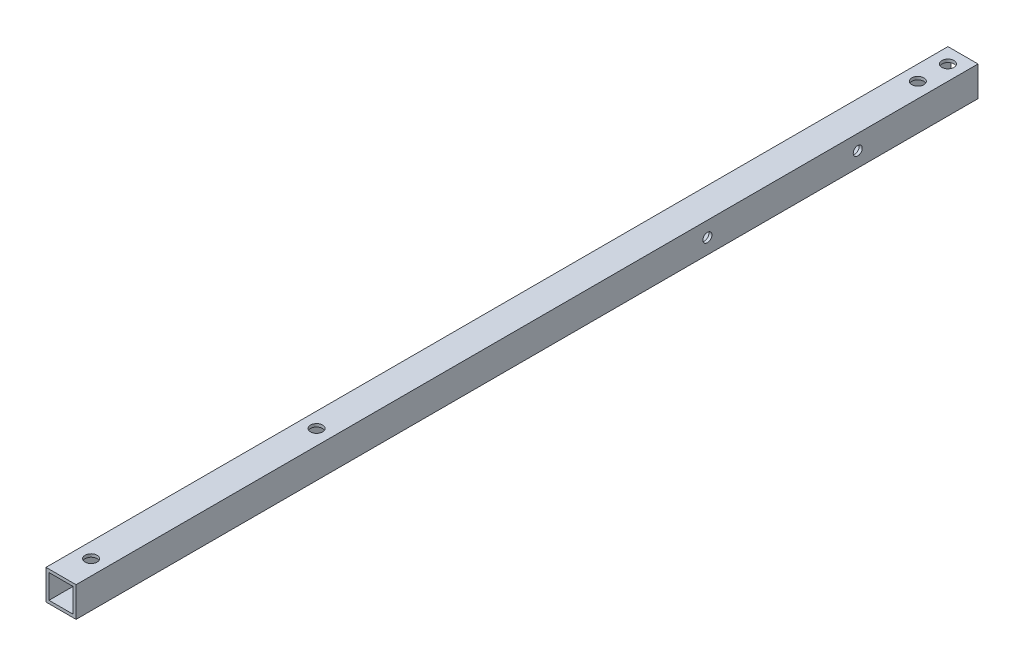
ISO-10303-21;
HEADER;
FILE_DESCRIPTION(('STEP AP214'),'2;1');
FILE_NAME('part.step','',(''),(''),'','','');
FILE_SCHEMA(('AUTOMOTIVE_DESIGN { 1 0 10303 214 1 1 1 1 }'));
ENDSEC;
DATA;
#1=APPLICATION_CONTEXT('core data for automotive mechanical design processes');
#2=APPLICATION_PROTOCOL_DEFINITION('international standard','automotive_design',2000,#1);
#3=PRODUCT_CONTEXT('',#1,'mechanical');
#4=PRODUCT('Part','Part','',(#3));
#5=PRODUCT_RELATED_PRODUCT_CATEGORY('part','',(#4));
#6=PRODUCT_DEFINITION_FORMATION('','',#4);
#7=PRODUCT_DEFINITION_CONTEXT('part definition',#1,'design');
#8=PRODUCT_DEFINITION('design','',#6,#7);
#9=PRODUCT_DEFINITION_SHAPE('','',#8);
#10=(LENGTH_UNIT() NAMED_UNIT(*) SI_UNIT(.MILLI.,.METRE.));
#11=(NAMED_UNIT(*) PLANE_ANGLE_UNIT() SI_UNIT($,.RADIAN.));
#12=(NAMED_UNIT(*) SI_UNIT($,.STERADIAN.) SOLID_ANGLE_UNIT());
#13=UNCERTAINTY_MEASURE_WITH_UNIT(LENGTH_MEASURE(1.E-05),#10,'distance_accuracy_value','');
#14=(GEOMETRIC_REPRESENTATION_CONTEXT(3) GLOBAL_UNCERTAINTY_ASSIGNED_CONTEXT((#13)) GLOBAL_UNIT_ASSIGNED_CONTEXT((#10,
#11,#12)) REPRESENTATION_CONTEXT('',''));
#15=CARTESIAN_POINT('',(0.,0.,0.));
#16=DIRECTION('',(0.,0.,1.));
#17=DIRECTION('',(1.,0.,0.));
#18=AXIS2_PLACEMENT_3D('',#15,#16,#17);
#19=CARTESIAN_POINT('',(0.,0.,300.));
#20=DIRECTION('',(0.,0.,1.));
#21=DIRECTION('',(1.,0.,0.));
#22=AXIS2_PLACEMENT_3D('',#19,#20,#21);
#23=PLANE('',#22);
#24=DIRECTION('',(0.,-1.,0.));
#25=VECTOR('',#24,1.);
#26=CARTESIAN_POINT('',(0.,0.,300.));
#27=LINE('',#26,#25);
#28=CARTESIAN_POINT('',(0.,0.,300.));
#29=VERTEX_POINT('',#28);
#30=CARTESIAN_POINT('',(0.,-10.,300.));
#31=VERTEX_POINT('',#30);
#32=EDGE_CURVE('E143',#29,#31,#27,.T.);
#33=ORIENTED_EDGE('',*,*,#32,.T.);
#34=DIRECTION('',(1.,0.,0.));
#35=VECTOR('',#34,1.);
#36=CARTESIAN_POINT('',(0.,-10.,300.));
#37=LINE('',#36,#35);
#38=CARTESIAN_POINT('',(10.,-10.,300.));
#39=VERTEX_POINT('',#38);
#40=EDGE_CURVE('E146',#31,#39,#37,.T.);
#41=ORIENTED_EDGE('',*,*,#40,.T.);
#42=DIRECTION('',(0.,1.,0.));
#43=VECTOR('',#42,1.);
#44=CARTESIAN_POINT('',(10.,0.,300.));
#45=LINE('',#44,#43);
#46=CARTESIAN_POINT('',(10.,0.,300.));
#47=VERTEX_POINT('',#46);
#48=EDGE_CURVE('E149',#39,#47,#45,.T.);
#49=ORIENTED_EDGE('',*,*,#48,.T.);
#50=DIRECTION('',(-1.,0.,0.));
#51=VECTOR('',#50,1.);
#52=CARTESIAN_POINT('',(0.,0.,300.));
#53=LINE('',#52,#51);
#54=EDGE_CURVE('E151',#47,#29,#53,.T.);
#55=ORIENTED_EDGE('',*,*,#54,.T.);
#56=EDGE_LOOP('',(#33,#41,#49,#55));
#57=FACE_BOUND('',#56,.T.);
#58=DIRECTION('',(1.,0.,0.));
#59=VECTOR('',#58,1.);
#60=CARTESIAN_POINT('',(1.,-9.,300.));
#61=LINE('',#60,#59);
#62=CARTESIAN_POINT('',(1.,-9.,300.));
#63=VERTEX_POINT('',#62);
#64=CARTESIAN_POINT('',(9.00000000000001,-9.,300.));
#65=VERTEX_POINT('',#64);
#66=EDGE_CURVE('E113',#63,#65,#61,.T.);
#67=ORIENTED_EDGE('',*,*,#66,.F.);
#68=DIRECTION('',(0.,-1.,0.));
#69=VECTOR('',#68,1.);
#70=CARTESIAN_POINT('',(1.,-1.,300.));
#71=LINE('',#70,#69);
#72=CARTESIAN_POINT('',(1.,-1.,300.));
#73=VERTEX_POINT('',#72);
#74=EDGE_CURVE('E105',#73,#63,#71,.T.);
#75=ORIENTED_EDGE('',*,*,#74,.F.);
#76=DIRECTION('',(-1.,0.,0.));
#77=VECTOR('',#76,1.);
#78=CARTESIAN_POINT('',(1.,-1.,300.));
#79=LINE('',#78,#77);
#80=CARTESIAN_POINT('',(9.,-1.,300.));
#81=VERTEX_POINT('',#80);
#82=EDGE_CURVE('E127',#81,#73,#79,.T.);
#83=ORIENTED_EDGE('',*,*,#82,.F.);
#84=DIRECTION('',(0.,1.,0.));
#85=VECTOR('',#84,1.);
#86=CARTESIAN_POINT('',(9.,-1.,300.));
#87=LINE('',#86,#85);
#88=EDGE_CURVE('E125',#65,#81,#87,.T.);
#89=ORIENTED_EDGE('',*,*,#88,.F.);
#90=EDGE_LOOP('',(#67,#75,#83,#89));
#91=FACE_BOUND('',#90,.T.);
#92=ADVANCED_FACE('F38',(#57,#91),#23,.T.);
#93=CARTESIAN_POINT('',(0.,0.,0.));
#94=DIRECTION('',(0.,0.,1.));
#95=DIRECTION('',(1.,0.,0.));
#96=AXIS2_PLACEMENT_3D('',#93,#94,#95);
#97=PLANE('',#96);
#98=DIRECTION('',(0.,-1.,0.));
#99=VECTOR('',#98,1.);
#100=CARTESIAN_POINT('',(0.,0.,0.));
#101=LINE('',#100,#99);
#102=CARTESIAN_POINT('',(0.,0.,0.));
#103=VERTEX_POINT('',#102);
#104=CARTESIAN_POINT('',(0.,-10.,0.));
#105=VERTEX_POINT('',#104);
#106=EDGE_CURVE('E121',#103,#105,#101,.T.);
#107=ORIENTED_EDGE('',*,*,#106,.F.);
#108=DIRECTION('',(-1.,0.,0.));
#109=VECTOR('',#108,1.);
#110=CARTESIAN_POINT('',(0.,0.,0.));
#111=LINE('',#110,#109);
#112=CARTESIAN_POINT('',(10.,0.,0.));
#113=VERTEX_POINT('',#112);
#114=EDGE_CURVE('E147',#113,#103,#111,.T.);
#115=ORIENTED_EDGE('',*,*,#114,.F.);
#116=DIRECTION('',(0.,1.,0.));
#117=VECTOR('',#116,1.);
#118=CARTESIAN_POINT('',(10.,0.,0.));
#119=LINE('',#118,#117);
#120=CARTESIAN_POINT('',(10.,-10.,0.));
#121=VERTEX_POINT('',#120);
#122=EDGE_CURVE('E158',#121,#113,#119,.T.);
#123=ORIENTED_EDGE('',*,*,#122,.F.);
#124=DIRECTION('',(1.,0.,0.));
#125=VECTOR('',#124,1.);
#126=CARTESIAN_POINT('',(0.,-10.,0.));
#127=LINE('',#126,#125);
#128=EDGE_CURVE('E156',#105,#121,#127,.T.);
#129=ORIENTED_EDGE('',*,*,#128,.F.);
#130=EDGE_LOOP('',(#107,#115,#123,#129));
#131=FACE_BOUND('',#130,.T.);
#132=DIRECTION('',(0.,-1.,0.));
#133=VECTOR('',#132,1.);
#134=CARTESIAN_POINT('',(1.,-1.,0.));
#135=LINE('',#134,#133);
#136=CARTESIAN_POINT('',(1.,-1.,0.));
#137=VERTEX_POINT('',#136);
#138=CARTESIAN_POINT('',(1.,-9.,0.));
#139=VERTEX_POINT('',#138);
#140=EDGE_CURVE('E63',#137,#139,#135,.T.);
#141=ORIENTED_EDGE('',*,*,#140,.T.);
#142=DIRECTION('',(1.,0.,0.));
#143=VECTOR('',#142,1.);
#144=CARTESIAN_POINT('',(1.,-9.,0.));
#145=LINE('',#144,#143);
#146=CARTESIAN_POINT('',(9.00000000000001,-9.,0.));
#147=VERTEX_POINT('',#146);
#148=EDGE_CURVE('E120',#139,#147,#145,.T.);
#149=ORIENTED_EDGE('',*,*,#148,.T.);
#150=DIRECTION('',(0.,1.,0.));
#151=VECTOR('',#150,1.);
#152=CARTESIAN_POINT('',(9.,-1.,0.));
#153=LINE('',#152,#151);
#154=CARTESIAN_POINT('',(9.,-1.,0.));
#155=VERTEX_POINT('',#154);
#156=EDGE_CURVE('E135',#147,#155,#153,.T.);
#157=ORIENTED_EDGE('',*,*,#156,.T.);
#158=DIRECTION('',(-1.,0.,0.));
#159=VECTOR('',#158,1.);
#160=CARTESIAN_POINT('',(1.,-1.,0.));
#161=LINE('',#160,#159);
#162=EDGE_CURVE('E114',#155,#137,#161,.T.);
#163=ORIENTED_EDGE('',*,*,#162,.T.);
#164=EDGE_LOOP('',(#141,#149,#157,#163));
#165=FACE_BOUND('',#164,.T.);
#166=ADVANCED_FACE('F255',(#131,#165),#97,.F.);
#167=CARTESIAN_POINT('',(0.,0.,300.));
#168=DIRECTION('',(1.,0.,0.));
#169=DIRECTION('',(0.,1.,0.));
#170=AXIS2_PLACEMENT_3D('',#167,#168,#169);
#171=PLANE('',#170);
#172=CARTESIAN_POINT('',(0.,-5.00000000000001,90.));
#173=DIRECTION('',(1.,0.,0.));
#174=DIRECTION('',(0.,1.,0.));
#175=AXIS2_PLACEMENT_3D('',#172,#173,#174);
#176=CIRCLE('',#175,1.5);
#177=CARTESIAN_POINT('',(0.,-3.50000000000002,90.));
#178=VERTEX_POINT('',#177);
#179=EDGE_CURVE('E347',#178,#178,#176,.T.);
#180=ORIENTED_EDGE('',*,*,#179,.T.);
#181=EDGE_LOOP('',(#180));
#182=FACE_BOUND('',#181,.T.);
#183=CARTESIAN_POINT('',(0.,-5.00000000000001,40.));
#184=DIRECTION('',(1.,0.,0.));
#185=DIRECTION('',(0.,1.,0.));
#186=AXIS2_PLACEMENT_3D('',#183,#184,#185);
#187=CIRCLE('',#186,1.5);
#188=CARTESIAN_POINT('',(0.,-3.5,40.));
#189=VERTEX_POINT('',#188);
#190=EDGE_CURVE('E189',#189,#189,#187,.T.);
#191=ORIENTED_EDGE('',*,*,#190,.T.);
#192=EDGE_LOOP('',(#191));
#193=FACE_BOUND('',#192,.T.);
#194=ORIENTED_EDGE('',*,*,#106,.T.);
#195=DIRECTION('',(0.,0.,-1.));
#196=VECTOR('',#195,1.);
#197=CARTESIAN_POINT('',(0.,-10.,300.));
#198=LINE('',#197,#196);
#199=EDGE_CURVE('E11',#31,#105,#198,.T.);
#200=ORIENTED_EDGE('',*,*,#199,.F.);
#201=ORIENTED_EDGE('',*,*,#32,.F.);
#202=DIRECTION('',(0.,0.,-1.));
#203=VECTOR('',#202,1.);
#204=CARTESIAN_POINT('',(0.,0.,300.));
#205=LINE('',#204,#203);
#206=EDGE_CURVE('E153',#29,#103,#205,.T.);
#207=ORIENTED_EDGE('',*,*,#206,.T.);
#208=EDGE_LOOP('',(#194,#200,#201,#207));
#209=FACE_BOUND('',#208,.T.);
#210=ADVANCED_FACE('F40',(#182,#193,#209),#171,.F.);
#211=CARTESIAN_POINT('',(0.,-10.,300.));
#212=DIRECTION('',(0.,1.,0.));
#213=DIRECTION('',(0.,0.,1.));
#214=AXIS2_PLACEMENT_3D('',#211,#212,#213);
#215=PLANE('',#214);
#216=CARTESIAN_POINT('',(5.00000000000003,-10.,215.));
#217=DIRECTION('',(0.,1.,0.));
#218=DIRECTION('',(0.,0.,1.));
#219=AXIS2_PLACEMENT_3D('',#216,#217,#218);
#220=CIRCLE('',#219,2.);
#221=CARTESIAN_POINT('',(5.00000000000003,-10.,217.));
#222=VERTEX_POINT('',#221);
#223=EDGE_CURVE('E185',#222,#222,#220,.T.);
#224=ORIENTED_EDGE('',*,*,#223,.T.);
#225=EDGE_LOOP('',(#224));
#226=FACE_BOUND('',#225,.T.);
#227=CARTESIAN_POINT('',(5.00000000000004,-10.,290.));
#228=DIRECTION('',(0.,1.,0.));
#229=DIRECTION('',(0.,0.,1.));
#230=AXIS2_PLACEMENT_3D('',#227,#228,#229);
#231=CIRCLE('',#230,2.);
#232=CARTESIAN_POINT('',(5.00000000000004,-10.,292.));
#233=VERTEX_POINT('',#232);
#234=EDGE_CURVE('E181',#233,#233,#231,.T.);
#235=ORIENTED_EDGE('',*,*,#234,.T.);
#236=EDGE_LOOP('',(#235));
#237=FACE_BOUND('',#236,.T.);
#238=CARTESIAN_POINT('',(5.,-10.,15.));
#239=DIRECTION('',(0.,1.,0.));
#240=DIRECTION('',(0.,0.,1.));
#241=AXIS2_PLACEMENT_3D('',#238,#239,#240);
#242=CIRCLE('',#241,2.);
#243=CARTESIAN_POINT('',(5.,-10.,17.));
#244=VERTEX_POINT('',#243);
#245=EDGE_CURVE('E176',#244,#244,#242,.T.);
#246=ORIENTED_EDGE('',*,*,#245,.T.);
#247=EDGE_LOOP('',(#246));
#248=FACE_BOUND('',#247,.T.);
#249=CARTESIAN_POINT('',(5.,-10.,5.));
#250=DIRECTION('',(0.,1.,0.));
#251=DIRECTION('',(0.,0.,1.));
#252=AXIS2_PLACEMENT_3D('',#249,#250,#251);
#253=CIRCLE('',#252,2.);
#254=CARTESIAN_POINT('',(5.,-10.,7.));
#255=VERTEX_POINT('',#254);
#256=EDGE_CURVE('E171',#255,#255,#253,.T.);
#257=ORIENTED_EDGE('',*,*,#256,.T.);
#258=EDGE_LOOP('',(#257));
#259=FACE_BOUND('',#258,.T.);
#260=ORIENTED_EDGE('',*,*,#128,.T.);
#261=DIRECTION('',(0.,0.,-1.));
#262=VECTOR('',#261,1.);
#263=CARTESIAN_POINT('',(10.,-10.,300.));
#264=LINE('',#263,#262);
#265=EDGE_CURVE('E47',#39,#121,#264,.T.);
#266=ORIENTED_EDGE('',*,*,#265,.F.);
#267=ORIENTED_EDGE('',*,*,#40,.F.);
#268=ORIENTED_EDGE('',*,*,#199,.T.);
#269=EDGE_LOOP('',(#260,#266,#267,#268));
#270=FACE_BOUND('',#269,.T.);
#271=ADVANCED_FACE('F268',(#226,#237,#248,#259,#270),#215,.F.);
#272=CARTESIAN_POINT('',(10.,0.,300.));
#273=DIRECTION('',(-1.,0.,0.));
#274=DIRECTION('',(0.,-1.,0.));
#275=AXIS2_PLACEMENT_3D('',#272,#273,#274);
#276=PLANE('',#275);
#277=CARTESIAN_POINT('',(10.,-5.00000000000001,90.));
#278=DIRECTION('',(1.,0.,0.));
#279=DIRECTION('',(0.,1.,0.));
#280=AXIS2_PLACEMENT_3D('',#277,#278,#279);
#281=CIRCLE('',#280,1.5);
#282=CARTESIAN_POINT('',(10.,-3.50000000000001,90.));
#283=VERTEX_POINT('',#282);
#284=EDGE_CURVE('E346',#283,#283,#281,.T.);
#285=ORIENTED_EDGE('',*,*,#284,.F.);
#286=EDGE_LOOP('',(#285));
#287=FACE_BOUND('',#286,.T.);
#288=CARTESIAN_POINT('',(10.,-5.00000000000001,40.));
#289=DIRECTION('',(1.,0.,0.));
#290=DIRECTION('',(0.,1.,0.));
#291=AXIS2_PLACEMENT_3D('',#288,#289,#290);
#292=CIRCLE('',#291,1.5);
#293=CARTESIAN_POINT('',(10.,-3.5,40.));
#294=VERTEX_POINT('',#293);
#295=EDGE_CURVE('E196',#294,#294,#292,.T.);
#296=ORIENTED_EDGE('',*,*,#295,.F.);
#297=EDGE_LOOP('',(#296));
#298=FACE_BOUND('',#297,.T.);
#299=ORIENTED_EDGE('',*,*,#122,.T.);
#300=DIRECTION('',(0.,0.,-1.));
#301=VECTOR('',#300,1.);
#302=CARTESIAN_POINT('',(10.,0.,300.));
#303=LINE('',#302,#301);
#304=EDGE_CURVE('E163',#47,#113,#303,.T.);
#305=ORIENTED_EDGE('',*,*,#304,.F.);
#306=ORIENTED_EDGE('',*,*,#48,.F.);
#307=ORIENTED_EDGE('',*,*,#265,.T.);
#308=EDGE_LOOP('',(#299,#305,#306,#307));
#309=FACE_BOUND('',#308,.T.);
#310=ADVANCED_FACE('F265',(#287,#298,#309),#276,.F.);
#311=CARTESIAN_POINT('',(0.,0.,300.));
#312=DIRECTION('',(0.,-1.,0.));
#313=DIRECTION('',(0.,0.,-1.));
#314=AXIS2_PLACEMENT_3D('',#311,#312,#313);
#315=PLANE('',#314);
#316=CARTESIAN_POINT('',(5.00000000000003,0.,215.));
#317=DIRECTION('',(0.,1.,0.));
#318=DIRECTION('',(0.,0.,1.));
#319=AXIS2_PLACEMENT_3D('',#316,#317,#318);
#320=CIRCLE('',#319,2.);
#321=CARTESIAN_POINT('',(5.00000000000003,0.,217.));
#322=VERTEX_POINT('',#321);
#323=EDGE_CURVE('E193',#322,#322,#320,.T.);
#324=ORIENTED_EDGE('',*,*,#323,.F.);
#325=EDGE_LOOP('',(#324));
#326=FACE_BOUND('',#325,.T.);
#327=CARTESIAN_POINT('',(5.00000000000004,0.,290.));
#328=DIRECTION('',(0.,1.,0.));
#329=DIRECTION('',(0.,0.,1.));
#330=AXIS2_PLACEMENT_3D('',#327,#328,#329);
#331=CIRCLE('',#330,2.);
#332=CARTESIAN_POINT('',(5.00000000000004,0.,292.));
#333=VERTEX_POINT('',#332);
#334=EDGE_CURVE('E212',#333,#333,#331,.T.);
#335=ORIENTED_EDGE('',*,*,#334,.F.);
#336=EDGE_LOOP('',(#335));
#337=FACE_BOUND('',#336,.T.);
#338=CARTESIAN_POINT('',(5.,0.,15.));
#339=DIRECTION('',(0.,1.,0.));
#340=DIRECTION('',(0.,0.,1.));
#341=AXIS2_PLACEMENT_3D('',#338,#339,#340);
#342=CIRCLE('',#341,2.);
#343=CARTESIAN_POINT('',(5.,0.,17.));
#344=VERTEX_POINT('',#343);
#345=EDGE_CURVE('E219',#344,#344,#342,.T.);
#346=ORIENTED_EDGE('',*,*,#345,.F.);
#347=EDGE_LOOP('',(#346));
#348=FACE_BOUND('',#347,.T.);
#349=CARTESIAN_POINT('',(5.,0.,5.));
#350=DIRECTION('',(0.,1.,0.));
#351=DIRECTION('',(0.,0.,1.));
#352=AXIS2_PLACEMENT_3D('',#349,#350,#351);
#353=CIRCLE('',#352,2.);
#354=CARTESIAN_POINT('',(5.,0.,7.));
#355=VERTEX_POINT('',#354);
#356=EDGE_CURVE('E226',#355,#355,#353,.T.);
#357=ORIENTED_EDGE('',*,*,#356,.F.);
#358=EDGE_LOOP('',(#357));
#359=FACE_BOUND('',#358,.T.);
#360=ORIENTED_EDGE('',*,*,#114,.T.);
#361=ORIENTED_EDGE('',*,*,#206,.F.);
#362=ORIENTED_EDGE('',*,*,#54,.F.);
#363=ORIENTED_EDGE('',*,*,#304,.T.);
#364=EDGE_LOOP('',(#360,#361,#362,#363));
#365=FACE_BOUND('',#364,.T.);
#366=ADVANCED_FACE('F249',(#326,#337,#348,#359,#365),#315,.F.);
#367=CARTESIAN_POINT('',(1.,-1.,300.));
#368=DIRECTION('',(1.,0.,0.));
#369=DIRECTION('',(0.,0.,-1.));
#370=AXIS2_PLACEMENT_3D('',#367,#368,#369);
#371=PLANE('',#370);
#372=CARTESIAN_POINT('',(1.,-5.00000000000001,90.));
#373=DIRECTION('',(1.,0.,0.));
#374=DIRECTION('',(0.,0.,-1.));
#375=AXIS2_PLACEMENT_3D('',#372,#373,#374);
#376=CIRCLE('',#375,1.5);
#377=CARTESIAN_POINT('',(1.,-5.00000000000001,88.5));
#378=VERTEX_POINT('',#377);
#379=EDGE_CURVE('E201',#378,#378,#376,.T.);
#380=ORIENTED_EDGE('',*,*,#379,.F.);
#381=EDGE_LOOP('',(#380));
#382=FACE_BOUND('',#381,.T.);
#383=CARTESIAN_POINT('',(1.,-5.00000000000001,40.));
#384=DIRECTION('',(1.,0.,0.));
#385=DIRECTION('',(0.,0.,-1.));
#386=AXIS2_PLACEMENT_3D('',#383,#384,#385);
#387=CIRCLE('',#386,1.5);
#388=CARTESIAN_POINT('',(1.,-5.00000000000001,38.5));
#389=VERTEX_POINT('',#388);
#390=EDGE_CURVE('E188',#389,#389,#387,.T.);
#391=ORIENTED_EDGE('',*,*,#390,.F.);
#392=EDGE_LOOP('',(#391));
#393=FACE_BOUND('',#392,.T.);
#394=ORIENTED_EDGE('',*,*,#140,.F.);
#395=DIRECTION('',(0.,0.,-1.));
#396=VECTOR('',#395,1.);
#397=CARTESIAN_POINT('',(1.,-1.,300.));
#398=LINE('',#397,#396);
#399=EDGE_CURVE('E109',#73,#137,#398,.T.);
#400=ORIENTED_EDGE('',*,*,#399,.F.);
#401=ORIENTED_EDGE('',*,*,#74,.T.);
#402=DIRECTION('',(0.,0.,-1.));
#403=VECTOR('',#402,1.);
#404=CARTESIAN_POINT('',(1.,-9.,300.));
#405=LINE('',#404,#403);
#406=EDGE_CURVE('E108',#63,#139,#405,.T.);
#407=ORIENTED_EDGE('',*,*,#406,.T.);
#408=EDGE_LOOP('',(#394,#400,#401,#407));
#409=FACE_BOUND('',#408,.T.);
#410=ADVANCED_FACE('F107',(#382,#393,#409),#371,.T.);
#411=CARTESIAN_POINT('',(1.,-9.,300.));
#412=DIRECTION('',(0.,1.,0.));
#413=DIRECTION('',(0.,0.,1.));
#414=AXIS2_PLACEMENT_3D('',#411,#412,#413);
#415=PLANE('',#414);
#416=CARTESIAN_POINT('',(5.00000000000003,-9.,215.));
#417=DIRECTION('',(0.,1.,0.));
#418=DIRECTION('',(0.,0.,1.));
#419=AXIS2_PLACEMENT_3D('',#416,#417,#418);
#420=CIRCLE('',#419,2.);
#421=CARTESIAN_POINT('',(5.00000000000003,-9.,217.));
#422=VERTEX_POINT('',#421);
#423=EDGE_CURVE('E184',#422,#422,#420,.T.);
#424=ORIENTED_EDGE('',*,*,#423,.F.);
#425=EDGE_LOOP('',(#424));
#426=FACE_BOUND('',#425,.T.);
#427=CARTESIAN_POINT('',(5.00000000000004,-9.,290.));
#428=DIRECTION('',(0.,1.,0.));
#429=DIRECTION('',(0.,0.,1.));
#430=AXIS2_PLACEMENT_3D('',#427,#428,#429);
#431=CIRCLE('',#430,2.);
#432=CARTESIAN_POINT('',(5.00000000000004,-9.,292.));
#433=VERTEX_POINT('',#432);
#434=EDGE_CURVE('E180',#433,#433,#431,.T.);
#435=ORIENTED_EDGE('',*,*,#434,.F.);
#436=EDGE_LOOP('',(#435));
#437=FACE_BOUND('',#436,.T.);
#438=CARTESIAN_POINT('',(5.,-9.,15.));
#439=DIRECTION('',(0.,1.,0.));
#440=DIRECTION('',(0.,0.,1.));
#441=AXIS2_PLACEMENT_3D('',#438,#439,#440);
#442=CIRCLE('',#441,2.);
#443=CARTESIAN_POINT('',(5.,-9.,17.));
#444=VERTEX_POINT('',#443);
#445=EDGE_CURVE('E175',#444,#444,#442,.T.);
#446=ORIENTED_EDGE('',*,*,#445,.F.);
#447=EDGE_LOOP('',(#446));
#448=FACE_BOUND('',#447,.T.);
#449=CARTESIAN_POINT('',(5.,-9.,5.));
#450=DIRECTION('',(0.,1.,0.));
#451=DIRECTION('',(0.,0.,1.));
#452=AXIS2_PLACEMENT_3D('',#449,#450,#451);
#453=CIRCLE('',#452,2.);
#454=CARTESIAN_POINT('',(5.,-9.,7.));
#455=VERTEX_POINT('',#454);
#456=EDGE_CURVE('E133',#455,#455,#453,.T.);
#457=ORIENTED_EDGE('',*,*,#456,.F.);
#458=EDGE_LOOP('',(#457));
#459=FACE_BOUND('',#458,.T.);
#460=ORIENTED_EDGE('',*,*,#148,.F.);
#461=ORIENTED_EDGE('',*,*,#406,.F.);
#462=ORIENTED_EDGE('',*,*,#66,.T.);
#463=DIRECTION('',(0.,0.,-1.));
#464=VECTOR('',#463,1.);
#465=CARTESIAN_POINT('',(9.00000000000001,-9.,300.));
#466=LINE('',#465,#464);
#467=EDGE_CURVE('E122',#65,#147,#466,.T.);
#468=ORIENTED_EDGE('',*,*,#467,.T.);
#469=EDGE_LOOP('',(#460,#461,#462,#468));
#470=FACE_BOUND('',#469,.T.);
#471=ADVANCED_FACE('F117',(#426,#437,#448,#459,#470),#415,.T.);
#472=CARTESIAN_POINT('',(9.,-1.,300.));
#473=DIRECTION('',(-1.,0.,0.));
#474=DIRECTION('',(0.,-1.,0.));
#475=AXIS2_PLACEMENT_3D('',#472,#473,#474);
#476=PLANE('',#475);
#477=CARTESIAN_POINT('',(9.00000000000001,-5.00000000000001,90.));
#478=DIRECTION('',(-1.,0.,0.));
#479=DIRECTION('',(0.,-1.,0.));
#480=AXIS2_PLACEMENT_3D('',#477,#478,#479);
#481=CIRCLE('',#480,1.5);
#482=CARTESIAN_POINT('',(9.00000000000001,-6.50000000000001,90.));
#483=VERTEX_POINT('',#482);
#484=EDGE_CURVE('E42',#483,#483,#481,.T.);
#485=ORIENTED_EDGE('',*,*,#484,.F.);
#486=EDGE_LOOP('',(#485));
#487=FACE_BOUND('',#486,.T.);
#488=CARTESIAN_POINT('',(9.00000000000001,-5.00000000000001,40.));
#489=DIRECTION('',(-1.,0.,0.));
#490=DIRECTION('',(0.,-1.,0.));
#491=AXIS2_PLACEMENT_3D('',#488,#489,#490);
#492=CIRCLE('',#491,1.5);
#493=CARTESIAN_POINT('',(9.00000000000001,-6.50000000000001,40.));
#494=VERTEX_POINT('',#493);
#495=EDGE_CURVE('E186',#494,#494,#492,.T.);
#496=ORIENTED_EDGE('',*,*,#495,.F.);
#497=EDGE_LOOP('',(#496));
#498=FACE_BOUND('',#497,.T.);
#499=ORIENTED_EDGE('',*,*,#156,.F.);
#500=ORIENTED_EDGE('',*,*,#467,.F.);
#501=ORIENTED_EDGE('',*,*,#88,.T.);
#502=DIRECTION('',(0.,0.,-1.));
#503=VECTOR('',#502,1.);
#504=CARTESIAN_POINT('',(9.,-1.,300.));
#505=LINE('',#504,#503);
#506=EDGE_CURVE('E55',#81,#155,#505,.T.);
#507=ORIENTED_EDGE('',*,*,#506,.T.);
#508=EDGE_LOOP('',(#499,#500,#501,#507));
#509=FACE_BOUND('',#508,.T.);
#510=ADVANCED_FACE('F237',(#487,#498,#509),#476,.T.);
#511=CARTESIAN_POINT('',(1.,-1.,300.));
#512=DIRECTION('',(0.,-1.,0.));
#513=DIRECTION('',(1.,0.,0.));
#514=AXIS2_PLACEMENT_3D('',#511,#512,#513);
#515=PLANE('',#514);
#516=CARTESIAN_POINT('',(5.00000000000003,-0.999999999999999,215.));
#517=DIRECTION('',(0.,-1.,0.));
#518=DIRECTION('',(1.,0.,0.));
#519=AXIS2_PLACEMENT_3D('',#516,#517,#518);
#520=CIRCLE('',#519,2.);
#521=CARTESIAN_POINT('',(7.00000000000003,-0.999999999999999,215.));
#522=VERTEX_POINT('',#521);
#523=EDGE_CURVE('E182',#522,#522,#520,.T.);
#524=ORIENTED_EDGE('',*,*,#523,.F.);
#525=EDGE_LOOP('',(#524));
#526=FACE_BOUND('',#525,.T.);
#527=CARTESIAN_POINT('',(5.00000000000004,-0.999999999999999,290.));
#528=DIRECTION('',(0.,-1.,0.));
#529=DIRECTION('',(1.,0.,0.));
#530=AXIS2_PLACEMENT_3D('',#527,#528,#529);
#531=CIRCLE('',#530,2.);
#532=CARTESIAN_POINT('',(7.00000000000003,-0.999999999999999,290.));
#533=VERTEX_POINT('',#532);
#534=EDGE_CURVE('E177',#533,#533,#531,.T.);
#535=ORIENTED_EDGE('',*,*,#534,.F.);
#536=EDGE_LOOP('',(#535));
#537=FACE_BOUND('',#536,.T.);
#538=CARTESIAN_POINT('',(5.,-0.999999999999999,15.));
#539=DIRECTION('',(0.,-1.,0.));
#540=DIRECTION('',(1.,0.,0.));
#541=AXIS2_PLACEMENT_3D('',#538,#539,#540);
#542=CIRCLE('',#541,2.);
#543=CARTESIAN_POINT('',(7.,-0.999999999999999,15.));
#544=VERTEX_POINT('',#543);
#545=EDGE_CURVE('E172',#544,#544,#542,.T.);
#546=ORIENTED_EDGE('',*,*,#545,.F.);
#547=EDGE_LOOP('',(#546));
#548=FACE_BOUND('',#547,.T.);
#549=CARTESIAN_POINT('',(5.,-0.999999999999999,5.));
#550=DIRECTION('',(0.,-1.,0.));
#551=DIRECTION('',(1.,0.,0.));
#552=AXIS2_PLACEMENT_3D('',#549,#550,#551);
#553=CIRCLE('',#552,2.);
#554=CARTESIAN_POINT('',(7.,-0.999999999999999,5.));
#555=VERTEX_POINT('',#554);
#556=EDGE_CURVE('E168',#555,#555,#553,.T.);
#557=ORIENTED_EDGE('',*,*,#556,.F.);
#558=EDGE_LOOP('',(#557));
#559=FACE_BOUND('',#558,.T.);
#560=ORIENTED_EDGE('',*,*,#162,.F.);
#561=ORIENTED_EDGE('',*,*,#506,.F.);
#562=ORIENTED_EDGE('',*,*,#82,.T.);
#563=ORIENTED_EDGE('',*,*,#399,.T.);
#564=EDGE_LOOP('',(#560,#561,#562,#563));
#565=FACE_BOUND('',#564,.T.);
#566=ADVANCED_FACE('F245',(#526,#537,#548,#559,#565),#515,.T.);
#567=CARTESIAN_POINT('',(5.,-10.,5.));
#568=DIRECTION('',(0.,1.,0.));
#569=DIRECTION('',(0.,0.,1.));
#570=AXIS2_PLACEMENT_3D('',#567,#568,#569);
#571=CYLINDRICAL_SURFACE('',#570,2.);
#572=ORIENTED_EDGE('',*,*,#556,.T.);
#573=EDGE_LOOP('',(#572));
#574=FACE_BOUND('',#573,.T.);
#575=ORIENTED_EDGE('',*,*,#356,.T.);
#576=EDGE_LOOP('',(#575));
#577=FACE_BOUND('',#576,.T.);
#578=ADVANCED_FACE('F300',(#574,#577),#571,.F.);
#579=ORIENTED_EDGE('',*,*,#456,.T.);
#580=EDGE_LOOP('',(#579));
#581=FACE_BOUND('',#580,.T.);
#582=ORIENTED_EDGE('',*,*,#256,.F.);
#583=EDGE_LOOP('',(#582));
#584=FACE_BOUND('',#583,.T.);
#585=ADVANCED_FACE('F233',(#581,#584),#571,.F.);
#586=CARTESIAN_POINT('',(5.,-10.,15.));
#587=DIRECTION('',(0.,1.,0.));
#588=DIRECTION('',(0.,0.,1.));
#589=AXIS2_PLACEMENT_3D('',#586,#587,#588);
#590=CYLINDRICAL_SURFACE('',#589,2.);
#591=ORIENTED_EDGE('',*,*,#545,.T.);
#592=EDGE_LOOP('',(#591));
#593=FACE_BOUND('',#592,.T.);
#594=ORIENTED_EDGE('',*,*,#345,.T.);
#595=EDGE_LOOP('',(#594));
#596=FACE_BOUND('',#595,.T.);
#597=ADVANCED_FACE('F312',(#593,#596),#590,.F.);
#598=ORIENTED_EDGE('',*,*,#445,.T.);
#599=EDGE_LOOP('',(#598));
#600=FACE_BOUND('',#599,.T.);
#601=ORIENTED_EDGE('',*,*,#245,.F.);
#602=EDGE_LOOP('',(#601));
#603=FACE_BOUND('',#602,.T.);
#604=ADVANCED_FACE('F315',(#600,#603),#590,.F.);
#605=CARTESIAN_POINT('',(5.00000000000004,-10.,290.));
#606=DIRECTION('',(0.,1.,0.));
#607=DIRECTION('',(0.,0.,1.));
#608=AXIS2_PLACEMENT_3D('',#605,#606,#607);
#609=CYLINDRICAL_SURFACE('',#608,2.);
#610=ORIENTED_EDGE('',*,*,#534,.T.);
#611=EDGE_LOOP('',(#610));
#612=FACE_BOUND('',#611,.T.);
#613=ORIENTED_EDGE('',*,*,#334,.T.);
#614=EDGE_LOOP('',(#613));
#615=FACE_BOUND('',#614,.T.);
#616=ADVANCED_FACE('F317',(#612,#615),#609,.F.);
#617=ORIENTED_EDGE('',*,*,#434,.T.);
#618=EDGE_LOOP('',(#617));
#619=FACE_BOUND('',#618,.T.);
#620=ORIENTED_EDGE('',*,*,#234,.F.);
#621=EDGE_LOOP('',(#620));
#622=FACE_BOUND('',#621,.T.);
#623=ADVANCED_FACE('F320',(#619,#622),#609,.F.);
#624=CARTESIAN_POINT('',(5.00000000000003,-10.,215.));
#625=DIRECTION('',(0.,1.,0.));
#626=DIRECTION('',(0.,0.,1.));
#627=AXIS2_PLACEMENT_3D('',#624,#625,#626);
#628=CYLINDRICAL_SURFACE('',#627,2.);
#629=ORIENTED_EDGE('',*,*,#523,.T.);
#630=EDGE_LOOP('',(#629));
#631=FACE_BOUND('',#630,.T.);
#632=ORIENTED_EDGE('',*,*,#323,.T.);
#633=EDGE_LOOP('',(#632));
#634=FACE_BOUND('',#633,.T.);
#635=ADVANCED_FACE('F322',(#631,#634),#628,.F.);
#636=ORIENTED_EDGE('',*,*,#423,.T.);
#637=EDGE_LOOP('',(#636));
#638=FACE_BOUND('',#637,.T.);
#639=ORIENTED_EDGE('',*,*,#223,.F.);
#640=EDGE_LOOP('',(#639));
#641=FACE_BOUND('',#640,.T.);
#642=ADVANCED_FACE('F325',(#638,#641),#628,.F.);
#643=CARTESIAN_POINT('',(0.,-5.00000000000001,40.));
#644=DIRECTION('',(1.,0.,0.));
#645=DIRECTION('',(0.,1.,0.));
#646=AXIS2_PLACEMENT_3D('',#643,#644,#645);
#647=CYLINDRICAL_SURFACE('',#646,1.5);
#648=ORIENTED_EDGE('',*,*,#495,.T.);
#649=EDGE_LOOP('',(#648));
#650=FACE_BOUND('',#649,.T.);
#651=ORIENTED_EDGE('',*,*,#295,.T.);
#652=EDGE_LOOP('',(#651));
#653=FACE_BOUND('',#652,.T.);
#654=ADVANCED_FACE('F327',(#650,#653),#647,.F.);
#655=ORIENTED_EDGE('',*,*,#390,.T.);
#656=EDGE_LOOP('',(#655));
#657=FACE_BOUND('',#656,.T.);
#658=ORIENTED_EDGE('',*,*,#190,.F.);
#659=EDGE_LOOP('',(#658));
#660=FACE_BOUND('',#659,.T.);
#661=ADVANCED_FACE('F330',(#657,#660),#647,.F.);
#662=CARTESIAN_POINT('',(0.,-5.00000000000001,90.));
#663=DIRECTION('',(1.,0.,0.));
#664=DIRECTION('',(0.,1.,0.));
#665=AXIS2_PLACEMENT_3D('',#662,#663,#664);
#666=CYLINDRICAL_SURFACE('',#665,1.5);
#667=ORIENTED_EDGE('',*,*,#484,.T.);
#668=EDGE_LOOP('',(#667));
#669=FACE_BOUND('',#668,.T.);
#670=ORIENTED_EDGE('',*,*,#284,.T.);
#671=EDGE_LOOP('',(#670));
#672=FACE_BOUND('',#671,.T.);
#673=ADVANCED_FACE('F331',(#669,#672),#666,.F.);
#674=ORIENTED_EDGE('',*,*,#379,.T.);
#675=EDGE_LOOP('',(#674));
#676=FACE_BOUND('',#675,.T.);
#677=ORIENTED_EDGE('',*,*,#179,.F.);
#678=EDGE_LOOP('',(#677));
#679=FACE_BOUND('',#678,.T.);
#680=ADVANCED_FACE('F333',(#676,#679),#666,.F.);
#681=CLOSED_SHELL('',(#92,#166,#210,#271,#310,#366,#410,#471,#510,#566,#578,#585,#597,#604,#616,
#623,#635,#642,#654,#661,#673,#680));
#682=MANIFOLD_SOLID_BREP('B2',#681);
#683=ADVANCED_BREP_SHAPE_REPRESENTATION('',(#18,#682),#14);
#684=SHAPE_DEFINITION_REPRESENTATION(#9,#683);
ENDSEC;
END-ISO-10303-21;
